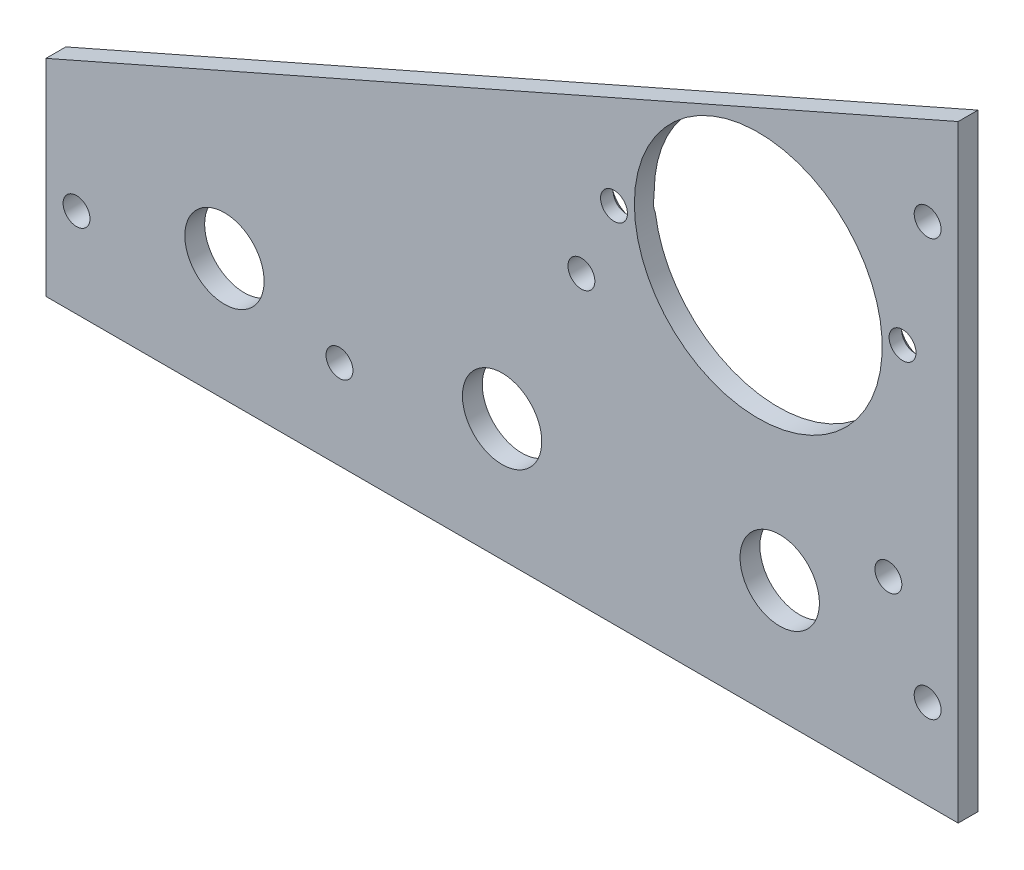
ISO-10303-21;
HEADER;
FILE_DESCRIPTION(('STEP AP214'),'2;1');
FILE_NAME('part.step','',(''),(''),'','','');
FILE_SCHEMA(('AUTOMOTIVE_DESIGN { 1 0 10303 214 1 1 1 1 }'));
ENDSEC;
DATA;
#1=APPLICATION_CONTEXT('core data for automotive mechanical design processes');
#2=APPLICATION_PROTOCOL_DEFINITION('international standard','automotive_design',2000,#1);
#3=PRODUCT_CONTEXT('',#1,'mechanical');
#4=PRODUCT('Part','Part','',(#3));
#5=PRODUCT_RELATED_PRODUCT_CATEGORY('part','',(#4));
#6=PRODUCT_DEFINITION_FORMATION('','',#4);
#7=PRODUCT_DEFINITION_CONTEXT('part definition',#1,'design');
#8=PRODUCT_DEFINITION('design','',#6,#7);
#9=PRODUCT_DEFINITION_SHAPE('','',#8);
#10=(LENGTH_UNIT() NAMED_UNIT(*) SI_UNIT(.MILLI.,.METRE.));
#11=(NAMED_UNIT(*) PLANE_ANGLE_UNIT() SI_UNIT($,.RADIAN.));
#12=(NAMED_UNIT(*) SI_UNIT($,.STERADIAN.) SOLID_ANGLE_UNIT());
#13=UNCERTAINTY_MEASURE_WITH_UNIT(LENGTH_MEASURE(1.E-05),#10,'distance_accuracy_value','');
#14=(GEOMETRIC_REPRESENTATION_CONTEXT(3) GLOBAL_UNCERTAINTY_ASSIGNED_CONTEXT((#13)) GLOBAL_UNIT_ASSIGNED_CONTEXT((#10,
#11,#12)) REPRESENTATION_CONTEXT('',''));
#15=CARTESIAN_POINT('',(0.,0.,0.));
#16=DIRECTION('',(0.,0.,1.));
#17=DIRECTION('',(1.,0.,0.));
#18=AXIS2_PLACEMENT_3D('',#15,#16,#17);
#19=CARTESIAN_POINT('',(0.,0.,-3.175));
#20=DIRECTION('',(1.,0.,0.));
#21=DIRECTION('',(0.,1.,0.));
#22=AXIS2_PLACEMENT_3D('',#19,#20,#21);
#23=PLANE('',#22);
#24=DIRECTION('',(0.,1.,0.));
#25=VECTOR('',#24,1.);
#26=CARTESIAN_POINT('',(0.,0.,0.));
#27=LINE('',#26,#25);
#28=CARTESIAN_POINT('',(0.,0.,0.));
#29=VERTEX_POINT('',#28);
#30=CARTESIAN_POINT('',(0.,97.282,0.));
#31=VERTEX_POINT('',#30);
#32=EDGE_CURVE('E149',#29,#31,#27,.T.);
#33=ORIENTED_EDGE('',*,*,#32,.F.);
#34=DIRECTION('',(0.,0.,1.));
#35=VECTOR('',#34,1.);
#36=CARTESIAN_POINT('',(0.,0.,-3.175));
#37=LINE('',#36,#35);
#38=CARTESIAN_POINT('',(0.,0.,-3.175));
#39=VERTEX_POINT('',#38);
#40=EDGE_CURVE('E174',#39,#29,#37,.T.);
#41=ORIENTED_EDGE('',*,*,#40,.F.);
#42=DIRECTION('',(0.,1.,0.));
#43=VECTOR('',#42,1.);
#44=CARTESIAN_POINT('',(0.,0.,-3.175));
#45=LINE('',#44,#43);
#46=CARTESIAN_POINT('',(0.,97.282,-3.175));
#47=VERTEX_POINT('',#46);
#48=EDGE_CURVE('E150',#39,#47,#45,.T.);
#49=ORIENTED_EDGE('',*,*,#48,.T.);
#50=DIRECTION('',(0.,0.,1.));
#51=VECTOR('',#50,1.);
#52=CARTESIAN_POINT('',(0.,97.282,-3.175));
#53=LINE('',#52,#51);
#54=EDGE_CURVE('E163',#47,#31,#53,.T.);
#55=ORIENTED_EDGE('',*,*,#54,.T.);
#56=EDGE_LOOP('',(#33,#41,#49,#55));
#57=FACE_BOUND('',#56,.T.);
#58=ADVANCED_FACE('F38',(#57),#23,.T.);
#59=CARTESIAN_POINT('',(-146.05,0.,-3.175));
#60=DIRECTION('',(0.,-1.,0.));
#61=DIRECTION('',(1.,0.,0.));
#62=AXIS2_PLACEMENT_3D('',#59,#60,#61);
#63=PLANE('',#62);
#64=DIRECTION('',(1.,0.,0.));
#65=VECTOR('',#64,1.);
#66=CARTESIAN_POINT('',(-146.05,0.,0.));
#67=LINE('',#66,#65);
#68=CARTESIAN_POINT('',(-146.05,0.,0.));
#69=VERTEX_POINT('',#68);
#70=EDGE_CURVE('E154',#69,#29,#67,.T.);
#71=ORIENTED_EDGE('',*,*,#70,.F.);
#72=DIRECTION('',(0.,0.,1.));
#73=VECTOR('',#72,1.);
#74=CARTESIAN_POINT('',(-146.05,0.,-3.175));
#75=LINE('',#74,#73);
#76=CARTESIAN_POINT('',(-146.05,0.,-3.175));
#77=VERTEX_POINT('',#76);
#78=EDGE_CURVE('E176',#77,#69,#75,.T.);
#79=ORIENTED_EDGE('',*,*,#78,.F.);
#80=DIRECTION('',(1.,0.,0.));
#81=VECTOR('',#80,1.);
#82=CARTESIAN_POINT('',(-146.05,0.,-3.175));
#83=LINE('',#82,#81);
#84=EDGE_CURVE('E160',#77,#39,#83,.T.);
#85=ORIENTED_EDGE('',*,*,#84,.T.);
#86=ORIENTED_EDGE('',*,*,#40,.T.);
#87=EDGE_LOOP('',(#71,#79,#85,#86));
#88=FACE_BOUND('',#87,.T.);
#89=ADVANCED_FACE('F217',(#88),#63,.T.);
#90=CARTESIAN_POINT('',(-146.05,33.02,-3.175));
#91=DIRECTION('',(-1.,0.,0.));
#92=DIRECTION('',(0.,0.,1.));
#93=AXIS2_PLACEMENT_3D('',#90,#91,#92);
#94=PLANE('',#93);
#95=DIRECTION('',(0.,-1.,0.));
#96=VECTOR('',#95,1.);
#97=CARTESIAN_POINT('',(-146.05,33.02,0.));
#98=LINE('',#97,#96);
#99=CARTESIAN_POINT('',(-146.05,33.02,0.));
#100=VERTEX_POINT('',#99);
#101=EDGE_CURVE('E169',#100,#69,#98,.T.);
#102=ORIENTED_EDGE('',*,*,#101,.F.);
#103=DIRECTION('',(0.,0.,1.));
#104=VECTOR('',#103,1.);
#105=CARTESIAN_POINT('',(-146.05,33.02,-3.175));
#106=LINE('',#105,#104);
#107=CARTESIAN_POINT('',(-146.05,33.02,-3.175));
#108=VERTEX_POINT('',#107);
#109=EDGE_CURVE('E178',#108,#100,#106,.T.);
#110=ORIENTED_EDGE('',*,*,#109,.F.);
#111=DIRECTION('',(0.,-1.,0.));
#112=VECTOR('',#111,1.);
#113=CARTESIAN_POINT('',(-146.05,33.02,-3.175));
#114=LINE('',#113,#112);
#115=EDGE_CURVE('E157',#108,#77,#114,.T.);
#116=ORIENTED_EDGE('',*,*,#115,.T.);
#117=ORIENTED_EDGE('',*,*,#78,.T.);
#118=EDGE_LOOP('',(#102,#110,#116,#117));
#119=FACE_BOUND('',#118,.T.);
#120=ADVANCED_FACE('F222',(#119),#94,.T.);
#121=CARTESIAN_POINT('',(0.,97.282,-3.175));
#122=DIRECTION('',(-0.402738614266017,0.915315032422766,0.));
#123=DIRECTION('',(-0.915315032422766,-0.402738614266017,0.));
#124=AXIS2_PLACEMENT_3D('',#121,#122,#123);
#125=PLANE('',#124);
#126=DIRECTION('',(-0.915315032422766,-0.402738614266017,0.));
#127=VECTOR('',#126,1.);
#128=CARTESIAN_POINT('',(0.,97.282,0.));
#129=LINE('',#128,#127);
#130=EDGE_CURVE('E166',#31,#100,#129,.T.);
#131=ORIENTED_EDGE('',*,*,#130,.F.);
#132=ORIENTED_EDGE('',*,*,#54,.F.);
#133=DIRECTION('',(-0.915315032422766,-0.402738614266017,0.));
#134=VECTOR('',#133,1.);
#135=CARTESIAN_POINT('',(0.,97.282,-3.175));
#136=LINE('',#135,#134);
#137=EDGE_CURVE('E153',#47,#108,#136,.T.);
#138=ORIENTED_EDGE('',*,*,#137,.T.);
#139=ORIENTED_EDGE('',*,*,#109,.T.);
#140=EDGE_LOOP('',(#131,#132,#138,#139));
#141=FACE_BOUND('',#140,.T.);
#142=ADVANCED_FACE('F237',(#141),#125,.T.);
#143=CARTESIAN_POINT('',(0.,0.,-3.175));
#144=DIRECTION('',(0.,0.,-1.));
#145=DIRECTION('',(-1.,0.,0.));
#146=AXIS2_PLACEMENT_3D('',#143,#144,#145);
#147=PLANE('',#146);
#148=CARTESIAN_POINT('',(-8.90404298659183,61.8383316047322,-3.175));
#149=DIRECTION('',(0.,0.,-1.));
#150=DIRECTION('',(-1.,0.,0.));
#151=AXIS2_PLACEMENT_3D('',#148,#149,#150);
#152=CIRCLE('',#151,3.5433);
#153=CARTESIAN_POINT('',(-12.3483727584603,62.6699368672337,-3.175));
#154=VERTEX_POINT('',#153);
#155=CARTESIAN_POINT('',(-12.1668743794886,60.4566998913125,-3.175));
#156=VERTEX_POINT('',#155);
#157=EDGE_CURVE('E57',#154,#156,#152,.T.);
#158=ORIENTED_EDGE('',*,*,#157,.F.);
#159=CARTESIAN_POINT('',(-32.004,59.944,-3.175));
#160=DIRECTION('',(0.,0.,-1.));
#161=DIRECTION('',(-1.,0.,0.));
#162=AXIS2_PLACEMENT_3D('',#159,#160,#161);
#163=CIRCLE('',#162,19.84375);
#164=CARTESIAN_POINT('',(-51.8411256205113,59.4313001086863,-3.175));
#165=VERTEX_POINT('',#164);
#166=EDGE_CURVE('E101',#165,#154,#163,.T.);
#167=ORIENTED_EDGE('',*,*,#166,.F.);
#168=CARTESIAN_POINT('',(-55.1039570134085,58.0496683952673,-3.175));
#169=DIRECTION('',(0.,0.,-1.));
#170=DIRECTION('',(-1.,0.,0.));
#171=AXIS2_PLACEMENT_3D('',#168,#169,#170);
#172=CIRCLE('',#171,3.5433);
#173=CARTESIAN_POINT('',(-51.6596272415397,57.2180631327668,-3.175));
#174=VERTEX_POINT('',#173);
#175=EDGE_CURVE('E63',#174,#165,#172,.T.);
#176=ORIENTED_EDGE('',*,*,#175,.F.);
#177=EDGE_CURVE('E102',#156,#174,#163,.T.);
#178=ORIENTED_EDGE('',*,*,#177,.F.);
#179=EDGE_LOOP('',(#158,#167,#176,#178));
#180=FACE_BOUND('',#179,.T.);
#181=CARTESIAN_POINT('',(-117.475,19.558,-3.175));
#182=DIRECTION('',(0.,0.,-1.));
#183=DIRECTION('',(-1.,0.,0.));
#184=AXIS2_PLACEMENT_3D('',#181,#182,#183);
#185=CIRCLE('',#184,6.35);
#186=CARTESIAN_POINT('',(-123.825,19.558,-3.175));
#187=VERTEX_POINT('',#186);
#188=EDGE_CURVE('E363',#187,#187,#185,.T.);
#189=ORIENTED_EDGE('',*,*,#188,.F.);
#190=EDGE_LOOP('',(#189));
#191=FACE_BOUND('',#190,.T.);
#192=CARTESIAN_POINT('',(-73.025,19.558,-3.175));
#193=DIRECTION('',(0.,0.,-1.));
#194=DIRECTION('',(-1.,0.,0.));
#195=AXIS2_PLACEMENT_3D('',#192,#193,#194);
#196=CIRCLE('',#195,6.35);
#197=CARTESIAN_POINT('',(-79.375,19.558,-3.175));
#198=VERTEX_POINT('',#197);
#199=EDGE_CURVE('E367',#198,#198,#196,.T.);
#200=ORIENTED_EDGE('',*,*,#199,.F.);
#201=EDGE_LOOP('',(#200));
#202=FACE_BOUND('',#201,.T.);
#203=CARTESIAN_POINT('',(-28.5749999999998,19.3758840270496,-3.175));
#204=DIRECTION('',(0.,0.,-1.));
#205=DIRECTION('',(-1.,0.,0.));
#206=AXIS2_PLACEMENT_3D('',#203,#204,#205);
#207=CIRCLE('',#206,6.35);
#208=CARTESIAN_POINT('',(-34.9249999999998,19.3758840270496,-3.175));
#209=VERTEX_POINT('',#208);
#210=EDGE_CURVE('E373',#209,#209,#207,.T.);
#211=ORIENTED_EDGE('',*,*,#210,.F.);
#212=EDGE_LOOP('',(#211));
#213=FACE_BOUND('',#212,.T.);
#214=CARTESIAN_POINT('',(-4.8895,80.9625,-3.175));
#215=DIRECTION('',(0.,0.,-1.));
#216=DIRECTION('',(-1.,0.,0.));
#217=AXIS2_PLACEMENT_3D('',#214,#215,#216);
#218=CIRCLE('',#217,2.15264999999999);
#219=CARTESIAN_POINT('',(-7.04214999999999,80.9625,-3.175));
#220=VERTEX_POINT('',#219);
#221=EDGE_CURVE('E109',#220,#220,#218,.T.);
#222=ORIENTED_EDGE('',*,*,#221,.F.);
#223=EDGE_LOOP('',(#222));
#224=FACE_BOUND('',#223,.T.);
#225=CARTESIAN_POINT('',(-4.8895,14.2875,-3.175));
#226=DIRECTION('',(0.,0.,-1.));
#227=DIRECTION('',(-1.,0.,0.));
#228=AXIS2_PLACEMENT_3D('',#225,#226,#227);
#229=CIRCLE('',#228,2.15264999999999);
#230=CARTESIAN_POINT('',(-7.04214999999999,14.2875,-3.175));
#231=VERTEX_POINT('',#230);
#232=EDGE_CURVE('E119',#231,#231,#229,.T.);
#233=ORIENTED_EDGE('',*,*,#232,.F.);
#234=EDGE_LOOP('',(#233));
#235=FACE_BOUND('',#234,.T.);
#236=CARTESIAN_POINT('',(-141.1605,14.2875,-3.175));
#237=DIRECTION('',(0.,0.,-1.));
#238=DIRECTION('',(-1.,0.,0.));
#239=AXIS2_PLACEMENT_3D('',#236,#237,#238);
#240=CIRCLE('',#239,2.15264999999998);
#241=CARTESIAN_POINT('',(-143.31315,14.2875,-3.175));
#242=VERTEX_POINT('',#241);
#243=EDGE_CURVE('E125',#242,#242,#240,.T.);
#244=ORIENTED_EDGE('',*,*,#243,.F.);
#245=EDGE_LOOP('',(#244));
#246=FACE_BOUND('',#245,.T.);
#247=CARTESIAN_POINT('',(-11.1759999999996,28.575,-3.175));
#248=DIRECTION('',(0.,0.,-1.));
#249=DIRECTION('',(-1.,0.,0.));
#250=AXIS2_PLACEMENT_3D('',#247,#248,#249);
#251=CIRCLE('',#250,2.15264999999999);
#252=CARTESIAN_POINT('',(-13.3286499999996,28.575,-3.175));
#253=VERTEX_POINT('',#252);
#254=EDGE_CURVE('E131',#253,#253,#251,.T.);
#255=ORIENTED_EDGE('',*,*,#254,.F.);
#256=EDGE_LOOP('',(#255));
#257=FACE_BOUND('',#256,.T.);
#258=CARTESIAN_POINT('',(-60.3249999999997,46.0375000000006,-3.175));
#259=DIRECTION('',(0.,0.,-1.));
#260=DIRECTION('',(-1.,0.,0.));
#261=AXIS2_PLACEMENT_3D('',#258,#259,#260);
#262=CIRCLE('',#261,2.15264999999999);
#263=CARTESIAN_POINT('',(-62.4776499999997,46.0375000000006,-3.175));
#264=VERTEX_POINT('',#263);
#265=EDGE_CURVE('E137',#264,#264,#262,.T.);
#266=ORIENTED_EDGE('',*,*,#265,.F.);
#267=EDGE_LOOP('',(#266));
#268=FACE_BOUND('',#267,.T.);
#269=CARTESIAN_POINT('',(-99.06,14.2875,-3.175));
#270=DIRECTION('',(0.,0.,-1.));
#271=DIRECTION('',(-1.,0.,0.));
#272=AXIS2_PLACEMENT_3D('',#269,#270,#271);
#273=CIRCLE('',#272,2.15264999999999);
#274=CARTESIAN_POINT('',(-101.21265,14.2875,-3.175));
#275=VERTEX_POINT('',#274);
#276=EDGE_CURVE('E143',#275,#275,#273,.T.);
#277=ORIENTED_EDGE('',*,*,#276,.F.);
#278=EDGE_LOOP('',(#277));
#279=FACE_BOUND('',#278,.T.);
#280=ORIENTED_EDGE('',*,*,#48,.F.);
#281=ORIENTED_EDGE('',*,*,#84,.F.);
#282=ORIENTED_EDGE('',*,*,#115,.F.);
#283=ORIENTED_EDGE('',*,*,#137,.F.);
#284=EDGE_LOOP('',(#280,#281,#282,#283));
#285=FACE_BOUND('',#284,.T.);
#286=ADVANCED_FACE('F99',(#180,#191,#202,#213,#224,#235,#246,#257,#268,#279,#285),#147,.T.);
#287=CARTESIAN_POINT('',(0.,0.,0.));
#288=DIRECTION('',(0.,0.,-1.));
#289=DIRECTION('',(-1.,0.,0.));
#290=AXIS2_PLACEMENT_3D('',#287,#288,#289);
#291=PLANE('',#290);
#292=CARTESIAN_POINT('',(-8.90404298659183,61.8383316047322,0.));
#293=DIRECTION('',(0.,0.,-1.));
#294=DIRECTION('',(-1.,0.,0.));
#295=AXIS2_PLACEMENT_3D('',#292,#293,#294);
#296=CIRCLE('',#295,2.15265);
#297=CARTESIAN_POINT('',(-11.0566929865918,61.8383316047322,0.));
#298=VERTEX_POINT('',#297);
#299=EDGE_CURVE('E350',#298,#298,#296,.T.);
#300=ORIENTED_EDGE('',*,*,#299,.T.);
#301=EDGE_LOOP('',(#300));
#302=FACE_BOUND('',#301,.T.);
#303=CARTESIAN_POINT('',(-55.1039570134085,58.0496683952673,0.));
#304=DIRECTION('',(0.,0.,-1.));
#305=DIRECTION('',(-1.,0.,0.));
#306=AXIS2_PLACEMENT_3D('',#303,#304,#305);
#307=CIRCLE('',#306,2.15265);
#308=CARTESIAN_POINT('',(-57.2566070134085,58.0496683952673,0.));
#309=VERTEX_POINT('',#308);
#310=EDGE_CURVE('E360',#309,#309,#307,.T.);
#311=ORIENTED_EDGE('',*,*,#310,.T.);
#312=EDGE_LOOP('',(#311));
#313=FACE_BOUND('',#312,.T.);
#314=CARTESIAN_POINT('',(-117.475,19.558,0.));
#315=DIRECTION('',(0.,0.,-1.));
#316=DIRECTION('',(-1.,0.,0.));
#317=AXIS2_PLACEMENT_3D('',#314,#315,#316);
#318=CIRCLE('',#317,6.35);
#319=CARTESIAN_POINT('',(-123.825,19.558,0.));
#320=VERTEX_POINT('',#319);
#321=EDGE_CURVE('E364',#320,#320,#318,.T.);
#322=ORIENTED_EDGE('',*,*,#321,.T.);
#323=EDGE_LOOP('',(#322));
#324=FACE_BOUND('',#323,.T.);
#325=CARTESIAN_POINT('',(-73.025,19.558,0.));
#326=DIRECTION('',(0.,0.,-1.));
#327=DIRECTION('',(-1.,0.,0.));
#328=AXIS2_PLACEMENT_3D('',#325,#326,#327);
#329=CIRCLE('',#328,6.35);
#330=CARTESIAN_POINT('',(-79.375,19.558,0.));
#331=VERTEX_POINT('',#330);
#332=EDGE_CURVE('E370',#331,#331,#329,.T.);
#333=ORIENTED_EDGE('',*,*,#332,.T.);
#334=EDGE_LOOP('',(#333));
#335=FACE_BOUND('',#334,.T.);
#336=CARTESIAN_POINT('',(-28.5749999999998,19.3758840270496,0.));
#337=DIRECTION('',(0.,0.,-1.));
#338=DIRECTION('',(-1.,0.,0.));
#339=AXIS2_PLACEMENT_3D('',#336,#337,#338);
#340=CIRCLE('',#339,6.35);
#341=CARTESIAN_POINT('',(-34.9249999999998,19.3758840270496,0.));
#342=VERTEX_POINT('',#341);
#343=EDGE_CURVE('E111',#342,#342,#340,.T.);
#344=ORIENTED_EDGE('',*,*,#343,.T.);
#345=EDGE_LOOP('',(#344));
#346=FACE_BOUND('',#345,.T.);
#347=CARTESIAN_POINT('',(-32.004,59.944,0.));
#348=DIRECTION('',(0.,0.,-1.));
#349=DIRECTION('',(-1.,0.,0.));
#350=AXIS2_PLACEMENT_3D('',#347,#348,#349);
#351=CIRCLE('',#350,19.84375);
#352=CARTESIAN_POINT('',(-51.84775,59.944,0.));
#353=VERTEX_POINT('',#352);
#354=EDGE_CURVE('E106',#353,#353,#351,.T.);
#355=ORIENTED_EDGE('',*,*,#354,.T.);
#356=EDGE_LOOP('',(#355));
#357=FACE_BOUND('',#356,.T.);
#358=CARTESIAN_POINT('',(-4.8895,80.9625,0.));
#359=DIRECTION('',(0.,0.,-1.));
#360=DIRECTION('',(-1.,0.,0.));
#361=AXIS2_PLACEMENT_3D('',#358,#359,#360);
#362=CIRCLE('',#361,2.15265);
#363=CARTESIAN_POINT('',(-7.04215,80.9625,0.));
#364=VERTEX_POINT('',#363);
#365=EDGE_CURVE('E116',#364,#364,#362,.T.);
#366=ORIENTED_EDGE('',*,*,#365,.T.);
#367=EDGE_LOOP('',(#366));
#368=FACE_BOUND('',#367,.T.);
#369=CARTESIAN_POINT('',(-4.8895,14.2875,0.));
#370=DIRECTION('',(0.,0.,-1.));
#371=DIRECTION('',(-1.,0.,0.));
#372=AXIS2_PLACEMENT_3D('',#369,#370,#371);
#373=CIRCLE('',#372,2.15265);
#374=CARTESIAN_POINT('',(-7.04215,14.2875,0.));
#375=VERTEX_POINT('',#374);
#376=EDGE_CURVE('E122',#375,#375,#373,.T.);
#377=ORIENTED_EDGE('',*,*,#376,.T.);
#378=EDGE_LOOP('',(#377));
#379=FACE_BOUND('',#378,.T.);
#380=CARTESIAN_POINT('',(-141.1605,14.2875,0.));
#381=DIRECTION('',(0.,0.,-1.));
#382=DIRECTION('',(-1.,0.,0.));
#383=AXIS2_PLACEMENT_3D('',#380,#381,#382);
#384=CIRCLE('',#383,2.15265000000001);
#385=CARTESIAN_POINT('',(-143.31315,14.2875,0.));
#386=VERTEX_POINT('',#385);
#387=EDGE_CURVE('E128',#386,#386,#384,.T.);
#388=ORIENTED_EDGE('',*,*,#387,.T.);
#389=EDGE_LOOP('',(#388));
#390=FACE_BOUND('',#389,.T.);
#391=CARTESIAN_POINT('',(-11.1759999999996,28.575,0.));
#392=DIRECTION('',(0.,0.,-1.));
#393=DIRECTION('',(-1.,0.,0.));
#394=AXIS2_PLACEMENT_3D('',#391,#392,#393);
#395=CIRCLE('',#394,2.15265);
#396=CARTESIAN_POINT('',(-13.3286499999996,28.575,0.));
#397=VERTEX_POINT('',#396);
#398=EDGE_CURVE('E134',#397,#397,#395,.T.);
#399=ORIENTED_EDGE('',*,*,#398,.T.);
#400=EDGE_LOOP('',(#399));
#401=FACE_BOUND('',#400,.T.);
#402=CARTESIAN_POINT('',(-60.3249999999997,46.0375000000006,0.));
#403=DIRECTION('',(0.,0.,-1.));
#404=DIRECTION('',(-1.,0.,0.));
#405=AXIS2_PLACEMENT_3D('',#402,#403,#404);
#406=CIRCLE('',#405,2.15265);
#407=CARTESIAN_POINT('',(-62.4776499999997,46.0375000000006,0.));
#408=VERTEX_POINT('',#407);
#409=EDGE_CURVE('E140',#408,#408,#406,.T.);
#410=ORIENTED_EDGE('',*,*,#409,.T.);
#411=EDGE_LOOP('',(#410));
#412=FACE_BOUND('',#411,.T.);
#413=CARTESIAN_POINT('',(-99.06,14.2875,0.));
#414=DIRECTION('',(0.,0.,-1.));
#415=DIRECTION('',(-1.,0.,0.));
#416=AXIS2_PLACEMENT_3D('',#413,#414,#415);
#417=CIRCLE('',#416,2.15264999999999);
#418=CARTESIAN_POINT('',(-101.21265,14.2875,0.));
#419=VERTEX_POINT('',#418);
#420=EDGE_CURVE('E146',#419,#419,#417,.T.);
#421=ORIENTED_EDGE('',*,*,#420,.T.);
#422=EDGE_LOOP('',(#421));
#423=FACE_BOUND('',#422,.T.);
#424=ORIENTED_EDGE('',*,*,#32,.T.);
#425=ORIENTED_EDGE('',*,*,#130,.T.);
#426=ORIENTED_EDGE('',*,*,#101,.T.);
#427=ORIENTED_EDGE('',*,*,#70,.T.);
#428=EDGE_LOOP('',(#424,#425,#426,#427));
#429=FACE_BOUND('',#428,.T.);
#430=ADVANCED_FACE('F230',(#302,#313,#324,#335,#346,#357,#368,#379,#390,#401,#412,#423,#429),
#291,.F.);
#431=CARTESIAN_POINT('',(-99.06,14.2875,-3.175));
#432=DIRECTION('',(0.,0.,-1.));
#433=DIRECTION('',(-1.,0.,0.));
#434=AXIS2_PLACEMENT_3D('',#431,#432,#433);
#435=CYLINDRICAL_SURFACE('',#434,2.15264999999999);
#436=ORIENTED_EDGE('',*,*,#420,.F.);
#437=EDGE_LOOP('',(#436));
#438=FACE_BOUND('',#437,.T.);
#439=ORIENTED_EDGE('',*,*,#276,.T.);
#440=EDGE_LOOP('',(#439));
#441=FACE_BOUND('',#440,.T.);
#442=ADVANCED_FACE('F247',(#438,#441),#435,.F.);
#443=CARTESIAN_POINT('',(-60.3249999999997,46.0375000000006,-3.175));
#444=DIRECTION('',(0.,0.,-1.));
#445=DIRECTION('',(-1.,0.,0.));
#446=AXIS2_PLACEMENT_3D('',#443,#444,#445);
#447=CYLINDRICAL_SURFACE('',#446,2.15265);
#448=ORIENTED_EDGE('',*,*,#409,.F.);
#449=EDGE_LOOP('',(#448));
#450=FACE_BOUND('',#449,.T.);
#451=ORIENTED_EDGE('',*,*,#265,.T.);
#452=EDGE_LOOP('',(#451));
#453=FACE_BOUND('',#452,.T.);
#454=ADVANCED_FACE('F253',(#450,#453),#447,.F.);
#455=CARTESIAN_POINT('',(-11.1759999999996,28.575,-3.175));
#456=DIRECTION('',(0.,0.,-1.));
#457=DIRECTION('',(-1.,0.,0.));
#458=AXIS2_PLACEMENT_3D('',#455,#456,#457);
#459=CYLINDRICAL_SURFACE('',#458,2.15264999999999);
#460=ORIENTED_EDGE('',*,*,#398,.F.);
#461=EDGE_LOOP('',(#460));
#462=FACE_BOUND('',#461,.T.);
#463=ORIENTED_EDGE('',*,*,#254,.T.);
#464=EDGE_LOOP('',(#463));
#465=FACE_BOUND('',#464,.T.);
#466=ADVANCED_FACE('F257',(#462,#465),#459,.F.);
#467=CARTESIAN_POINT('',(-141.1605,14.2875,-3.175));
#468=DIRECTION('',(0.,0.,-1.));
#469=DIRECTION('',(-1.,0.,0.));
#470=AXIS2_PLACEMENT_3D('',#467,#468,#469);
#471=CYLINDRICAL_SURFACE('',#470,2.15264999999999);
#472=ORIENTED_EDGE('',*,*,#387,.F.);
#473=EDGE_LOOP('',(#472));
#474=FACE_BOUND('',#473,.T.);
#475=ORIENTED_EDGE('',*,*,#243,.T.);
#476=EDGE_LOOP('',(#475));
#477=FACE_BOUND('',#476,.T.);
#478=ADVANCED_FACE('F261',(#474,#477),#471,.F.);
#479=CARTESIAN_POINT('',(-4.8895,14.2875,-3.175));
#480=DIRECTION('',(0.,0.,-1.));
#481=DIRECTION('',(-1.,0.,0.));
#482=AXIS2_PLACEMENT_3D('',#479,#480,#481);
#483=CYLINDRICAL_SURFACE('',#482,2.15264999999999);
#484=ORIENTED_EDGE('',*,*,#376,.F.);
#485=EDGE_LOOP('',(#484));
#486=FACE_BOUND('',#485,.T.);
#487=ORIENTED_EDGE('',*,*,#232,.T.);
#488=EDGE_LOOP('',(#487));
#489=FACE_BOUND('',#488,.T.);
#490=ADVANCED_FACE('F265',(#486,#489),#483,.F.);
#491=CARTESIAN_POINT('',(-4.8895,80.9625,-3.175));
#492=DIRECTION('',(0.,0.,-1.));
#493=DIRECTION('',(-1.,0.,0.));
#494=AXIS2_PLACEMENT_3D('',#491,#492,#493);
#495=CYLINDRICAL_SURFACE('',#494,2.15264999999999);
#496=ORIENTED_EDGE('',*,*,#365,.F.);
#497=EDGE_LOOP('',(#496));
#498=FACE_BOUND('',#497,.T.);
#499=ORIENTED_EDGE('',*,*,#221,.T.);
#500=EDGE_LOOP('',(#499));
#501=FACE_BOUND('',#500,.T.);
#502=ADVANCED_FACE('F212',(#498,#501),#495,.F.);
#503=CARTESIAN_POINT('',(-32.004,59.944,0.));
#504=DIRECTION('',(0.,0.,-1.));
#505=DIRECTION('',(-1.,0.,0.));
#506=AXIS2_PLACEMENT_3D('',#503,#504,#505);
#507=CYLINDRICAL_SURFACE('',#506,19.84375);
#508=ORIENTED_EDGE('',*,*,#354,.F.);
#509=EDGE_LOOP('',(#508));
#510=FACE_BOUND('',#509,.T.);
#511=ORIENTED_EDGE('',*,*,#166,.T.);
#512=CARTESIAN_POINT('',(-12.348462204089,62.6705817457051,-3.1752));
#513=CARTESIAN_POINT('',(-12.3343439399146,62.56884515849,-3.14359198782465));
#514=CARTESIAN_POINT('',(-12.3208612297739,62.4658075949407,-3.1155710481766));
#515=CARTESIAN_POINT('',(-12.2952937092437,62.257499922763,-3.06782784223267));
#516=CARTESIAN_POINT('',(-12.2832111069735,62.152226589306,-3.04811855851726));
#517=CARTESIAN_POINT('',(-12.2609299791083,61.9430889735372,-3.01864488814701));
#518=CARTESIAN_POINT('',(-12.2506883663298,61.8392670544008,-3.00861891667263));
#519=CARTESIAN_POINT('',(-12.2318202557341,61.6310768163946,-2.99819835432568));
#520=CARTESIAN_POINT('',(-12.2231923025578,61.5267090780006,-2.99779504281172));
#521=CARTESIAN_POINT('',(-12.2093563882201,61.3415337565773,-3.00563052471257));
#522=CARTESIAN_POINT('',(-12.2038148519886,61.2606636319275,-3.01196171770309));
#523=CARTESIAN_POINT('',(-12.1937555367999,61.0994856890566,-3.03018171776802));
#524=CARTESIAN_POINT('',(-12.1892378022048,61.0191778953477,-3.04207076559969));
#525=CARTESIAN_POINT('',(-12.1811262271883,60.8576594843337,-3.07132053166147));
#526=CARTESIAN_POINT('',(-12.1775554751246,60.7764692421232,-3.08879840335844));
#527=CARTESIAN_POINT('',(-12.1714443028695,60.6153118657116,-3.12854766030411));
#528=CARTESIAN_POINT('',(-12.1689028629816,60.53534359692,-3.1508142678972));
#529=CARTESIAN_POINT('',(-12.1668575690346,60.4560490563319,-3.1752));
#530=B_SPLINE_CURVE_WITH_KNOTS('',3,(#512,#513,#514,#515,#516,#517,#518,#519,#520,#521,#522,
#523,#524,#525,#526,#527,#528,#529),.UNSPECIFIED.,.F.,.F.,(4,2,2,2,2,2,2,2,4),(0.,
0.322468355659283,0.645438549073151,0.959417439452713,1.27311177219187,1.51683494577062,
1.7605686780207,2.00978936751021,2.25876255697656),.UNSPECIFIED.);
#531=EDGE_CURVE('E11',#154,#156,#530,.T.);
#532=ORIENTED_EDGE('',*,*,#531,.T.);
#533=ORIENTED_EDGE('',*,*,#177,.T.);
#534=CARTESIAN_POINT('',(-51.659537795911,57.2174182542947,-3.17520000000019));
#535=CARTESIAN_POINT('',(-51.6736560600853,57.3191548415098,-3.14359198782485));
#536=CARTESIAN_POINT('',(-51.6871387702261,57.4221924050592,-3.1155710481768));
#537=CARTESIAN_POINT('',(-51.7127062907563,57.6305000772369,-3.06782784223289));
#538=CARTESIAN_POINT('',(-51.7247888930264,57.7357734106939,-3.04811855851749));
#539=CARTESIAN_POINT('',(-51.7470700208917,57.9449110264627,-3.01864488814726));
#540=CARTESIAN_POINT('',(-51.7573116336702,58.0487329455991,-3.00861891667288));
#541=CARTESIAN_POINT('',(-51.7761797442659,58.2569231836053,-2.99819835432595));
#542=CARTESIAN_POINT('',(-51.7848076974422,58.3612909219992,-2.99779504281199));
#543=CARTESIAN_POINT('',(-51.7986436117799,58.5464662434225,-3.00563052471286));
#544=CARTESIAN_POINT('',(-51.8041851480114,58.6273363680723,-3.01196171770337));
#545=CARTESIAN_POINT('',(-51.8142444632001,58.7885143109432,-3.0301817177683));
#546=CARTESIAN_POINT('',(-51.8187621977952,58.868822104652,-3.04207076559997));
#547=CARTESIAN_POINT('',(-51.8268737728116,59.0303405156659,-3.07132053166174));
#548=CARTESIAN_POINT('',(-51.8304445248754,59.1115307578763,-3.0887984033587));
#549=CARTESIAN_POINT('',(-51.8365556971305,59.2726881342879,-3.12854766030433));
#550=CARTESIAN_POINT('',(-51.8390971370184,59.3526564030794,-3.15081426789741));
#551=CARTESIAN_POINT('',(-51.8411424309654,59.4319509436675,-3.17520000000019));
#552=B_SPLINE_CURVE_WITH_KNOTS('',3,(#534,#535,#536,#537,#538,#539,#540,#541,#542,#543,#544,
#545,#546,#547,#548,#549,#550,#551),.UNSPECIFIED.,.F.,.F.,(4,2,2,2,2,2,2,2,4),(0.,
0.322468355659284,0.645438549073148,0.959417439452708,1.27311177219185,1.51683494577049,
1.76056867802046,2.00978936750984,2.25876255697607),.UNSPECIFIED.);
#553=EDGE_CURVE('E51',#174,#165,#552,.T.);
#554=ORIENTED_EDGE('',*,*,#553,.T.);
#555=EDGE_LOOP('',(#511,#532,#533,#554));
#556=FACE_BOUND('',#555,.T.);
#557=ADVANCED_FACE('F105',(#510,#556),#507,.F.);
#558=CARTESIAN_POINT('',(-28.5749999999998,19.3758840270496,0.));
#559=DIRECTION('',(0.,0.,-1.));
#560=DIRECTION('',(-1.,0.,0.));
#561=AXIS2_PLACEMENT_3D('',#558,#559,#560);
#562=CYLINDRICAL_SURFACE('',#561,6.35);
#563=ORIENTED_EDGE('',*,*,#343,.F.);
#564=EDGE_LOOP('',(#563));
#565=FACE_BOUND('',#564,.T.);
#566=ORIENTED_EDGE('',*,*,#210,.T.);
#567=EDGE_LOOP('',(#566));
#568=FACE_BOUND('',#567,.T.);
#569=ADVANCED_FACE('F205',(#565,#568),#562,.F.);
#570=CARTESIAN_POINT('',(-73.025,19.558,0.));
#571=DIRECTION('',(0.,0.,-1.));
#572=DIRECTION('',(-1.,0.,0.));
#573=AXIS2_PLACEMENT_3D('',#570,#571,#572);
#574=CYLINDRICAL_SURFACE('',#573,6.35);
#575=ORIENTED_EDGE('',*,*,#332,.F.);
#576=EDGE_LOOP('',(#575));
#577=FACE_BOUND('',#576,.T.);
#578=ORIENTED_EDGE('',*,*,#199,.T.);
#579=EDGE_LOOP('',(#578));
#580=FACE_BOUND('',#579,.T.);
#581=ADVANCED_FACE('F202',(#577,#580),#574,.F.);
#582=CARTESIAN_POINT('',(-117.475,19.558,0.));
#583=DIRECTION('',(0.,0.,-1.));
#584=DIRECTION('',(-1.,0.,0.));
#585=AXIS2_PLACEMENT_3D('',#582,#583,#584);
#586=CYLINDRICAL_SURFACE('',#585,6.35);
#587=ORIENTED_EDGE('',*,*,#321,.F.);
#588=EDGE_LOOP('',(#587));
#589=FACE_BOUND('',#588,.T.);
#590=ORIENTED_EDGE('',*,*,#188,.T.);
#591=EDGE_LOOP('',(#590));
#592=FACE_BOUND('',#591,.T.);
#593=ADVANCED_FACE('F194',(#589,#592),#586,.F.);
#594=CARTESIAN_POINT('',(-55.1039570134085,58.0496683952673,-3.175));
#595=DIRECTION('',(0.,0.,-1.));
#596=DIRECTION('',(-1.,0.,0.));
#597=AXIS2_PLACEMENT_3D('',#594,#595,#596);
#598=CONICAL_SURFACE('',#597,3.5433,0.872664625997164);
#599=CARTESIAN_POINT('',(-55.1039570134085,58.0496683952673,-2.00810609790331));
#600=DIRECTION('',(0.,0.,-1.));
#601=DIRECTION('',(-1.,0.,0.));
#602=AXIS2_PLACEMENT_3D('',#599,#600,#601);
#603=CIRCLE('',#602,2.15265);
#604=CARTESIAN_POINT('',(-57.2566070134085,58.0496683952673,-2.00810609790331));
#605=VERTEX_POINT('',#604);
#606=EDGE_CURVE('E357',#605,#605,#603,.T.);
#607=ORIENTED_EDGE('',*,*,#606,.F.);
#608=EDGE_LOOP('',(#607));
#609=FACE_BOUND('',#608,.T.);
#610=ORIENTED_EDGE('',*,*,#175,.T.);
#611=ORIENTED_EDGE('',*,*,#553,.F.);
#612=EDGE_LOOP('',(#610,#611));
#613=FACE_BOUND('',#612,.T.);
#614=ADVANCED_FACE('F188',(#609,#613),#598,.F.);
#615=CARTESIAN_POINT('',(-55.1039570134085,58.0496683952673,-3.175));
#616=DIRECTION('',(0.,0.,-1.));
#617=DIRECTION('',(-1.,0.,0.));
#618=AXIS2_PLACEMENT_3D('',#615,#616,#617);
#619=CYLINDRICAL_SURFACE('',#618,2.15265);
#620=ORIENTED_EDGE('',*,*,#310,.F.);
#621=EDGE_LOOP('',(#620));
#622=FACE_BOUND('',#621,.T.);
#623=ORIENTED_EDGE('',*,*,#606,.T.);
#624=EDGE_LOOP('',(#623));
#625=FACE_BOUND('',#624,.T.);
#626=ADVANCED_FACE('F193',(#622,#625),#619,.F.);
#627=CARTESIAN_POINT('',(-8.90404298659183,61.8383316047322,-3.175));
#628=DIRECTION('',(0.,0.,-1.));
#629=DIRECTION('',(-1.,0.,0.));
#630=AXIS2_PLACEMENT_3D('',#627,#628,#629);
#631=CONICAL_SURFACE('',#630,3.5433,0.872664625997165);
#632=CARTESIAN_POINT('',(-8.90404298659183,61.8383316047322,-2.00810609790331));
#633=DIRECTION('',(0.,0.,-1.));
#634=DIRECTION('',(-1.,0.,0.));
#635=AXIS2_PLACEMENT_3D('',#632,#633,#634);
#636=CIRCLE('',#635,2.15265);
#637=CARTESIAN_POINT('',(-11.0566929865918,61.8383316047322,-2.00810609790331));
#638=VERTEX_POINT('',#637);
#639=EDGE_CURVE('E103',#638,#638,#636,.T.);
#640=ORIENTED_EDGE('',*,*,#639,.F.);
#641=EDGE_LOOP('',(#640));
#642=FACE_BOUND('',#641,.T.);
#643=ORIENTED_EDGE('',*,*,#157,.T.);
#644=ORIENTED_EDGE('',*,*,#531,.F.);
#645=EDGE_LOOP('',(#643,#644));
#646=FACE_BOUND('',#645,.T.);
#647=ADVANCED_FACE('F93',(#642,#646),#631,.F.);
#648=CARTESIAN_POINT('',(-8.90404298659183,61.8383316047322,-3.175));
#649=DIRECTION('',(0.,0.,-1.));
#650=DIRECTION('',(-1.,0.,0.));
#651=AXIS2_PLACEMENT_3D('',#648,#649,#650);
#652=CYLINDRICAL_SURFACE('',#651,2.15265);
#653=ORIENTED_EDGE('',*,*,#299,.F.);
#654=EDGE_LOOP('',(#653));
#655=FACE_BOUND('',#654,.T.);
#656=ORIENTED_EDGE('',*,*,#639,.T.);
#657=EDGE_LOOP('',(#656));
#658=FACE_BOUND('',#657,.T.);
#659=ADVANCED_FACE('F196',(#655,#658),#652,.F.);
#660=CLOSED_SHELL('',(#58,#89,#120,#142,#286,#430,#442,#454,#466,#478,#490,#502,#557,#569,#581,
#593,#614,#626,#647,#659));
#661=MANIFOLD_SOLID_BREP('B2',#660);
#662=ADVANCED_BREP_SHAPE_REPRESENTATION('',(#18,#661),#14);
#663=SHAPE_DEFINITION_REPRESENTATION(#9,#662);
ENDSEC;
END-ISO-10303-21;
